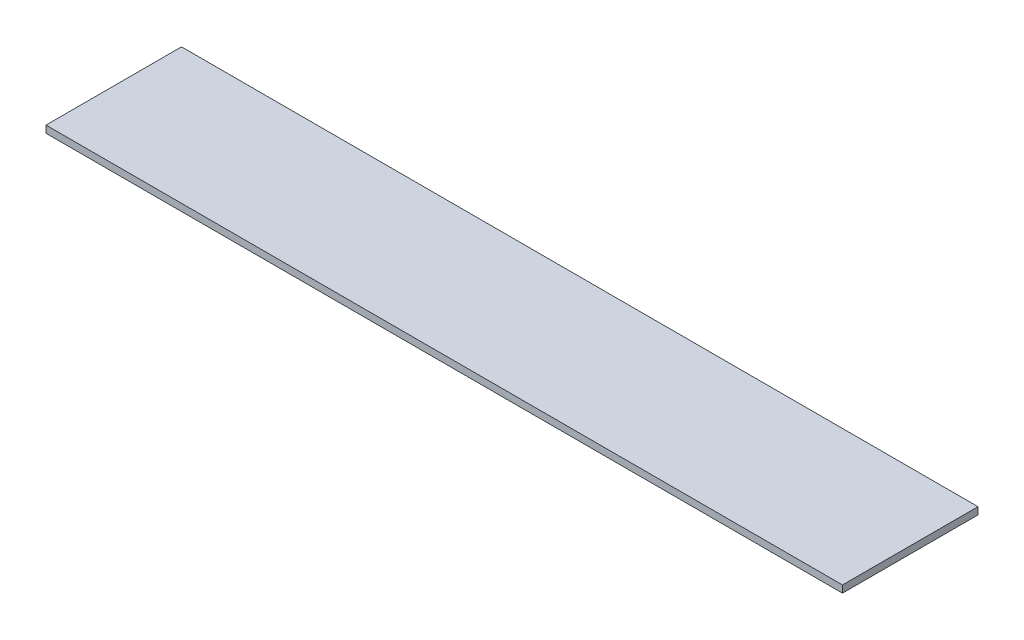
ISO-10303-21;
HEADER;
FILE_DESCRIPTION(('STEP AP214'),'2;1');
FILE_NAME('part.step','',(''),(''),'','','');
FILE_SCHEMA(('AUTOMOTIVE_DESIGN { 1 0 10303 214 1 1 1 1 }'));
ENDSEC;
DATA;
#1=APPLICATION_CONTEXT('core data for automotive mechanical design processes');
#2=APPLICATION_PROTOCOL_DEFINITION('international standard','automotive_design',2000,#1);
#3=PRODUCT_CONTEXT('',#1,'mechanical');
#4=PRODUCT('Part','Part','',(#3));
#5=PRODUCT_RELATED_PRODUCT_CATEGORY('part','',(#4));
#6=PRODUCT_DEFINITION_FORMATION('','',#4);
#7=PRODUCT_DEFINITION_CONTEXT('part definition',#1,'design');
#8=PRODUCT_DEFINITION('design','',#6,#7);
#9=PRODUCT_DEFINITION_SHAPE('','',#8);
#10=(LENGTH_UNIT() NAMED_UNIT(*) SI_UNIT(.MILLI.,.METRE.));
#11=(NAMED_UNIT(*) PLANE_ANGLE_UNIT() SI_UNIT($,.RADIAN.));
#12=(NAMED_UNIT(*) SI_UNIT($,.STERADIAN.) SOLID_ANGLE_UNIT());
#13=UNCERTAINTY_MEASURE_WITH_UNIT(LENGTH_MEASURE(1.E-05),#10,'distance_accuracy_value','');
#14=(GEOMETRIC_REPRESENTATION_CONTEXT(3) GLOBAL_UNCERTAINTY_ASSIGNED_CONTEXT((#13)) GLOBAL_UNIT_ASSIGNED_CONTEXT((#10,
#11,#12)) REPRESENTATION_CONTEXT('',''));
#15=CARTESIAN_POINT('',(0.,0.,0.));
#16=DIRECTION('',(0.,0.,1.));
#17=DIRECTION('',(1.,0.,0.));
#18=AXIS2_PLACEMENT_3D('',#15,#16,#17);
#19=CARTESIAN_POINT('',(167.5,3.,28.5));
#20=DIRECTION('',(-1.,0.,0.));
#21=DIRECTION('',(0.,0.,1.));
#22=AXIS2_PLACEMENT_3D('',#19,#20,#21);
#23=PLANE('',#22);
#24=DIRECTION('',(0.,0.,-1.));
#25=VECTOR('',#24,1.);
#26=CARTESIAN_POINT('',(167.5,0.,28.5));
#27=LINE('',#26,#25);
#28=CARTESIAN_POINT('',(167.5,0.,28.5));
#29=VERTEX_POINT('',#28);
#30=CARTESIAN_POINT('',(167.5,0.,-28.5));
#31=VERTEX_POINT('',#30);
#32=EDGE_CURVE('E97',#29,#31,#27,.T.);
#33=ORIENTED_EDGE('',*,*,#32,.T.);
#34=DIRECTION('',(0.,-1.,0.));
#35=VECTOR('',#34,1.);
#36=CARTESIAN_POINT('',(167.5,3.,-28.5));
#37=LINE('',#36,#35);
#38=CARTESIAN_POINT('',(167.5,3.,-28.5));
#39=VERTEX_POINT('',#38);
#40=EDGE_CURVE('E11',#39,#31,#37,.T.);
#41=ORIENTED_EDGE('',*,*,#40,.F.);
#42=DIRECTION('',(0.,0.,-1.));
#43=VECTOR('',#42,1.);
#44=CARTESIAN_POINT('',(167.5,3.,28.5));
#45=LINE('',#44,#43);
#46=CARTESIAN_POINT('',(167.5,3.,28.5));
#47=VERTEX_POINT('',#46);
#48=EDGE_CURVE('E85',#47,#39,#45,.T.);
#49=ORIENTED_EDGE('',*,*,#48,.F.);
#50=DIRECTION('',(0.,-1.,0.));
#51=VECTOR('',#50,1.);
#52=CARTESIAN_POINT('',(167.5,3.,28.5));
#53=LINE('',#52,#51);
#54=EDGE_CURVE('E93',#47,#29,#53,.T.);
#55=ORIENTED_EDGE('',*,*,#54,.T.);
#56=EDGE_LOOP('',(#33,#41,#49,#55));
#57=FACE_BOUND('',#56,.T.);
#58=ADVANCED_FACE('F34',(#57),#23,.F.);
#59=CARTESIAN_POINT('',(-167.5,3.,-28.5));
#60=DIRECTION('',(0.,0.,1.));
#61=DIRECTION('',(1.,0.,0.));
#62=AXIS2_PLACEMENT_3D('',#59,#60,#61);
#63=PLANE('',#62);
#64=DIRECTION('',(-1.,0.,0.));
#65=VECTOR('',#64,1.);
#66=CARTESIAN_POINT('',(-167.5,0.,-28.5));
#67=LINE('',#66,#65);
#68=CARTESIAN_POINT('',(-167.5,0.,-28.5));
#69=VERTEX_POINT('',#68);
#70=EDGE_CURVE('E89',#31,#69,#67,.T.);
#71=ORIENTED_EDGE('',*,*,#70,.T.);
#72=DIRECTION('',(0.,-1.,0.));
#73=VECTOR('',#72,1.);
#74=CARTESIAN_POINT('',(-167.5,3.,-28.5));
#75=LINE('',#74,#73);
#76=CARTESIAN_POINT('',(-167.5,3.,-28.5));
#77=VERTEX_POINT('',#76);
#78=EDGE_CURVE('E42',#77,#69,#75,.T.);
#79=ORIENTED_EDGE('',*,*,#78,.F.);
#80=DIRECTION('',(-1.,0.,0.));
#81=VECTOR('',#80,1.);
#82=CARTESIAN_POINT('',(-167.5,3.,-28.5));
#83=LINE('',#82,#81);
#84=EDGE_CURVE('E80',#39,#77,#83,.T.);
#85=ORIENTED_EDGE('',*,*,#84,.F.);
#86=ORIENTED_EDGE('',*,*,#40,.T.);
#87=EDGE_LOOP('',(#71,#79,#85,#86));
#88=FACE_BOUND('',#87,.T.);
#89=ADVANCED_FACE('F88',(#88),#63,.F.);
#90=CARTESIAN_POINT('',(-167.5,3.,28.5));
#91=DIRECTION('',(1.,0.,0.));
#92=DIRECTION('',(0.,0.,-1.));
#93=AXIS2_PLACEMENT_3D('',#90,#91,#92);
#94=PLANE('',#93);
#95=DIRECTION('',(0.,0.,1.));
#96=VECTOR('',#95,1.);
#97=CARTESIAN_POINT('',(-167.5,0.,28.5));
#98=LINE('',#97,#96);
#99=CARTESIAN_POINT('',(-167.5,0.,28.5));
#100=VERTEX_POINT('',#99);
#101=EDGE_CURVE('E67',#69,#100,#98,.T.);
#102=ORIENTED_EDGE('',*,*,#101,.T.);
#103=DIRECTION('',(0.,-1.,0.));
#104=VECTOR('',#103,1.);
#105=CARTESIAN_POINT('',(-167.5,3.,28.5));
#106=LINE('',#105,#104);
#107=CARTESIAN_POINT('',(-167.5,3.,28.5));
#108=VERTEX_POINT('',#107);
#109=EDGE_CURVE('E90',#108,#100,#106,.T.);
#110=ORIENTED_EDGE('',*,*,#109,.F.);
#111=DIRECTION('',(0.,0.,1.));
#112=VECTOR('',#111,1.);
#113=CARTESIAN_POINT('',(-167.5,3.,28.5));
#114=LINE('',#113,#112);
#115=EDGE_CURVE('E83',#77,#108,#114,.T.);
#116=ORIENTED_EDGE('',*,*,#115,.F.);
#117=ORIENTED_EDGE('',*,*,#78,.T.);
#118=EDGE_LOOP('',(#102,#110,#116,#117));
#119=FACE_BOUND('',#118,.T.);
#120=ADVANCED_FACE('F91',(#119),#94,.F.);
#121=CARTESIAN_POINT('',(-167.5,3.,28.5));
#122=DIRECTION('',(0.,0.,-1.));
#123=DIRECTION('',(-1.,0.,0.));
#124=AXIS2_PLACEMENT_3D('',#121,#122,#123);
#125=PLANE('',#124);
#126=DIRECTION('',(1.,0.,0.));
#127=VECTOR('',#126,1.);
#128=CARTESIAN_POINT('',(-167.5,0.,28.5));
#129=LINE('',#128,#127);
#130=EDGE_CURVE('E73',#100,#29,#129,.T.);
#131=ORIENTED_EDGE('',*,*,#130,.T.);
#132=ORIENTED_EDGE('',*,*,#54,.F.);
#133=DIRECTION('',(1.,0.,0.));
#134=VECTOR('',#133,1.);
#135=CARTESIAN_POINT('',(-167.5,3.,28.5));
#136=LINE('',#135,#134);
#137=EDGE_CURVE('E50',#108,#47,#136,.T.);
#138=ORIENTED_EDGE('',*,*,#137,.F.);
#139=ORIENTED_EDGE('',*,*,#109,.T.);
#140=EDGE_LOOP('',(#131,#132,#138,#139));
#141=FACE_BOUND('',#140,.T.);
#142=ADVANCED_FACE('F104',(#141),#125,.F.);
#143=CARTESIAN_POINT('',(0.,3.,0.));
#144=DIRECTION('',(0.,-1.,0.));
#145=DIRECTION('',(0.,0.,-1.));
#146=AXIS2_PLACEMENT_3D('',#143,#144,#145);
#147=PLANE('',#146);
#148=ORIENTED_EDGE('',*,*,#48,.T.);
#149=ORIENTED_EDGE('',*,*,#84,.T.);
#150=ORIENTED_EDGE('',*,*,#115,.T.);
#151=ORIENTED_EDGE('',*,*,#137,.T.);
#152=EDGE_LOOP('',(#148,#149,#150,#151));
#153=FACE_BOUND('',#152,.T.);
#154=ADVANCED_FACE('F81',(#153),#147,.F.);
#155=CARTESIAN_POINT('',(0.,0.,0.));
#156=DIRECTION('',(0.,-1.,0.));
#157=DIRECTION('',(0.,0.,-1.));
#158=AXIS2_PLACEMENT_3D('',#155,#156,#157);
#159=PLANE('',#158);
#160=ORIENTED_EDGE('',*,*,#32,.F.);
#161=ORIENTED_EDGE('',*,*,#130,.F.);
#162=ORIENTED_EDGE('',*,*,#101,.F.);
#163=ORIENTED_EDGE('',*,*,#70,.F.);
#164=EDGE_LOOP('',(#160,#161,#162,#163));
#165=FACE_BOUND('',#164,.T.);
#166=ADVANCED_FACE('F107',(#165),#159,.T.);
#167=CLOSED_SHELL('',(#58,#89,#120,#142,#154,#166));
#168=MANIFOLD_SOLID_BREP('B2',#167);
#169=ADVANCED_BREP_SHAPE_REPRESENTATION('',(#18,#168),#14);
#170=SHAPE_DEFINITION_REPRESENTATION(#9,#169);
ENDSEC;
END-ISO-10303-21;
